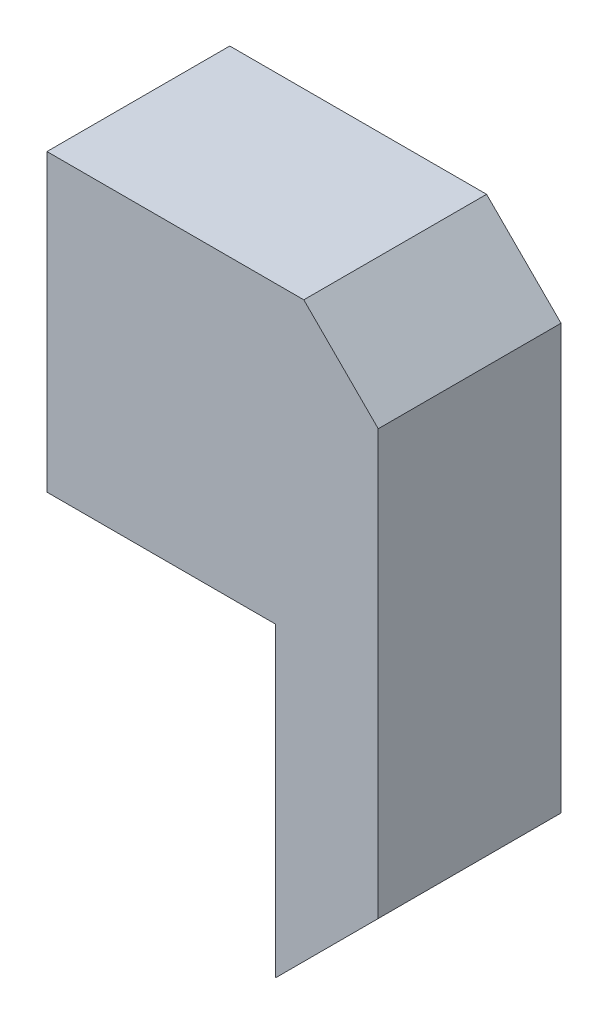
ISO-10303-21;
HEADER;
FILE_DESCRIPTION(('STEP AP214'),'2;1');
FILE_NAME('part.step','',(''),(''),'','','');
FILE_SCHEMA(('AUTOMOTIVE_DESIGN { 1 0 10303 214 1 1 1 1 }'));
ENDSEC;
DATA;
#1=APPLICATION_CONTEXT('core data for automotive mechanical design processes');
#2=APPLICATION_PROTOCOL_DEFINITION('international standard','automotive_design',2000,#1);
#3=PRODUCT_CONTEXT('',#1,'mechanical');
#4=PRODUCT('Part','Part','',(#3));
#5=PRODUCT_RELATED_PRODUCT_CATEGORY('part','',(#4));
#6=PRODUCT_DEFINITION_FORMATION('','',#4);
#7=PRODUCT_DEFINITION_CONTEXT('part definition',#1,'design');
#8=PRODUCT_DEFINITION('design','',#6,#7);
#9=PRODUCT_DEFINITION_SHAPE('','',#8);
#10=(LENGTH_UNIT() NAMED_UNIT(*) SI_UNIT(.MILLI.,.METRE.));
#11=(NAMED_UNIT(*) PLANE_ANGLE_UNIT() SI_UNIT($,.RADIAN.));
#12=(NAMED_UNIT(*) SI_UNIT($,.STERADIAN.) SOLID_ANGLE_UNIT());
#13=UNCERTAINTY_MEASURE_WITH_UNIT(LENGTH_MEASURE(1.E-05),#10,'distance_accuracy_value','');
#14=(GEOMETRIC_REPRESENTATION_CONTEXT(3) GLOBAL_UNCERTAINTY_ASSIGNED_CONTEXT((#13)) GLOBAL_UNIT_ASSIGNED_CONTEXT((#10,
#11,#12)) REPRESENTATION_CONTEXT('',''));
#15=CARTESIAN_POINT('',(0.,0.,0.));
#16=DIRECTION('',(0.,0.,1.));
#17=DIRECTION('',(1.,0.,0.));
#18=AXIS2_PLACEMENT_3D('',#15,#16,#17);
#19=CARTESIAN_POINT('',(313.287913377162,0.,-250.825));
#20=DIRECTION('',(0.,-1.,0.));
#21=DIRECTION('',(1.,0.,0.));
#22=AXIS2_PLACEMENT_3D('',#19,#20,#21);
#23=PLANE('',#22);
#24=DIRECTION('',(0.,0.,1.));
#25=VECTOR('',#24,1.);
#26=CARTESIAN_POINT('',(1.5875,0.,-250.825));
#27=LINE('',#26,#25);
#28=CARTESIAN_POINT('',(1.5875,0.,-249.2375));
#29=VERTEX_POINT('',#28);
#30=CARTESIAN_POINT('',(1.5875,0.,-1.5875));
#31=VERTEX_POINT('',#30);
#32=EDGE_CURVE('E140',#29,#31,#27,.T.);
#33=ORIENTED_EDGE('',*,*,#32,.T.);
#34=DIRECTION('',(1.,0.,0.));
#35=VECTOR('',#34,1.);
#36=CARTESIAN_POINT('',(313.287913377162,0.,-1.58749999999999));
#37=LINE('',#36,#35);
#38=CARTESIAN_POINT('',(313.287913377162,0.,-1.58749999999999));
#39=VERTEX_POINT('',#38);
#40=EDGE_CURVE('E169',#31,#39,#37,.T.);
#41=ORIENTED_EDGE('',*,*,#40,.T.);
#42=DIRECTION('',(0.,0.,1.));
#43=VECTOR('',#42,1.);
#44=CARTESIAN_POINT('',(313.287913377162,0.,-250.825));
#45=LINE('',#44,#43);
#46=CARTESIAN_POINT('',(313.287913377162,0.,0.));
#47=VERTEX_POINT('',#46);
#48=EDGE_CURVE('E135',#39,#47,#45,.T.);
#49=ORIENTED_EDGE('',*,*,#48,.T.);
#50=DIRECTION('',(1.,0.,0.));
#51=VECTOR('',#50,1.);
#52=CARTESIAN_POINT('',(313.287913377162,0.,0.));
#53=LINE('',#52,#51);
#54=CARTESIAN_POINT('',(0.,0.,0.));
#55=VERTEX_POINT('',#54);
#56=EDGE_CURVE('E136',#55,#47,#53,.T.);
#57=ORIENTED_EDGE('',*,*,#56,.F.);
#58=DIRECTION('',(0.,0.,1.));
#59=VECTOR('',#58,1.);
#60=CARTESIAN_POINT('',(0.,0.,-250.825));
#61=LINE('',#60,#59);
#62=CARTESIAN_POINT('',(0.,0.,-250.825));
#63=VERTEX_POINT('',#62);
#64=EDGE_CURVE('E11',#63,#55,#61,.T.);
#65=ORIENTED_EDGE('',*,*,#64,.F.);
#66=DIRECTION('',(1.,0.,0.));
#67=VECTOR('',#66,1.);
#68=CARTESIAN_POINT('',(313.287913377162,0.,-250.825));
#69=LINE('',#68,#67);
#70=CARTESIAN_POINT('',(313.287913377162,0.,-250.825));
#71=VERTEX_POINT('',#70);
#72=EDGE_CURVE('E154',#63,#71,#69,.T.);
#73=ORIENTED_EDGE('',*,*,#72,.T.);
#74=CARTESIAN_POINT('',(313.287913377162,0.,-249.2375));
#75=VERTEX_POINT('',#74);
#76=EDGE_CURVE('E34',#71,#75,#45,.T.);
#77=ORIENTED_EDGE('',*,*,#76,.T.);
#78=DIRECTION('',(1.,0.,0.));
#79=VECTOR('',#78,1.);
#80=CARTESIAN_POINT('',(313.287913377162,0.,-249.2375));
#81=LINE('',#80,#79);
#82=EDGE_CURVE('E334',#29,#75,#81,.T.);
#83=ORIENTED_EDGE('',*,*,#82,.F.);
#84=EDGE_LOOP('',(#33,#41,#49,#57,#65,#73,#77,#83));
#85=FACE_BOUND('',#84,.T.);
#86=ADVANCED_FACE('F31',(#85),#23,.T.);
#87=CARTESIAN_POINT('',(313.287913377162,-420.6875,-250.825));
#88=DIRECTION('',(-1.,0.,0.));
#89=DIRECTION('',(0.,0.,1.));
#90=AXIS2_PLACEMENT_3D('',#87,#88,#89);
#91=PLANE('',#90);
#92=ORIENTED_EDGE('',*,*,#48,.F.);
#93=DIRECTION('',(0.,-1.,0.));
#94=VECTOR('',#93,1.);
#95=CARTESIAN_POINT('',(313.287913377162,-420.6875,-1.58749999999999));
#96=LINE('',#95,#94);
#97=CARTESIAN_POINT('',(313.287913377162,-418.442435969733,-1.5875));
#98=VERTEX_POINT('',#97);
#99=EDGE_CURVE('E324',#39,#98,#96,.T.);
#100=ORIENTED_EDGE('',*,*,#99,.T.);
#101=DIRECTION('',(0.,0.,1.));
#102=VECTOR('',#101,1.);
#103=CARTESIAN_POINT('',(313.287913377162,-418.442435969733,-250.825));
#104=LINE('',#103,#102);
#105=CARTESIAN_POINT('',(313.287913377162,-418.442435969733,-249.2375));
#106=VERTEX_POINT('',#105);
#107=EDGE_CURVE('E327',#106,#98,#104,.T.);
#108=ORIENTED_EDGE('',*,*,#107,.F.);
#109=DIRECTION('',(0.,-1.,0.));
#110=VECTOR('',#109,1.);
#111=CARTESIAN_POINT('',(313.287913377162,-420.6875,-249.2375));
#112=LINE('',#111,#110);
#113=EDGE_CURVE('E47',#75,#106,#112,.T.);
#114=ORIENTED_EDGE('',*,*,#113,.F.);
#115=ORIENTED_EDGE('',*,*,#76,.F.);
#116=DIRECTION('',(0.,-1.,0.));
#117=VECTOR('',#116,1.);
#118=CARTESIAN_POINT('',(313.287913377162,-420.6875,-250.825));
#119=LINE('',#118,#117);
#120=CARTESIAN_POINT('',(313.287913377162,-420.6875,-250.825));
#121=VERTEX_POINT('',#120);
#122=EDGE_CURVE('E319',#71,#121,#119,.T.);
#123=ORIENTED_EDGE('',*,*,#122,.T.);
#124=DIRECTION('',(0.,0.,1.));
#125=VECTOR('',#124,1.);
#126=CARTESIAN_POINT('',(313.287913377162,-420.6875,-250.825));
#127=LINE('',#126,#125);
#128=CARTESIAN_POINT('',(313.287913377162,-420.6875,0.));
#129=VERTEX_POINT('',#128);
#130=EDGE_CURVE('E159',#121,#129,#127,.T.);
#131=ORIENTED_EDGE('',*,*,#130,.T.);
#132=DIRECTION('',(0.,-1.,0.));
#133=VECTOR('',#132,1.);
#134=CARTESIAN_POINT('',(313.287913377162,-420.6875,0.));
#135=LINE('',#134,#133);
#136=EDGE_CURVE('E139',#47,#129,#135,.T.);
#137=ORIENTED_EDGE('',*,*,#136,.F.);
#138=EDGE_LOOP('',(#92,#100,#108,#114,#115,#123,#131,#137));
#139=FACE_BOUND('',#138,.T.);
#140=ADVANCED_FACE('F171',(#139),#91,.T.);
#141=CARTESIAN_POINT('',(0.,0.,-250.825));
#142=DIRECTION('',(-1.,0.,0.));
#143=DIRECTION('',(0.,0.,1.));
#144=AXIS2_PLACEMENT_3D('',#141,#142,#143);
#145=PLANE('',#144);
#146=DIRECTION('',(0.,-1.,0.));
#147=VECTOR('',#146,1.);
#148=CARTESIAN_POINT('',(0.,0.,0.));
#149=LINE('',#148,#147);
#150=CARTESIAN_POINT('',(0.,404.8125,0.));
#151=VERTEX_POINT('',#150);
#152=EDGE_CURVE('E152',#151,#55,#149,.T.);
#153=ORIENTED_EDGE('',*,*,#152,.F.);
#154=DIRECTION('',(0.,0.,1.));
#155=VECTOR('',#154,1.);
#156=CARTESIAN_POINT('',(0.,404.8125,-250.825));
#157=LINE('',#156,#155);
#158=CARTESIAN_POINT('',(0.,404.8125,-250.825));
#159=VERTEX_POINT('',#158);
#160=EDGE_CURVE('E39',#159,#151,#157,.T.);
#161=ORIENTED_EDGE('',*,*,#160,.F.);
#162=DIRECTION('',(0.,-1.,0.));
#163=VECTOR('',#162,1.);
#164=CARTESIAN_POINT('',(0.,0.,-250.825));
#165=LINE('',#164,#163);
#166=EDGE_CURVE('E125',#159,#63,#165,.T.);
#167=ORIENTED_EDGE('',*,*,#166,.T.);
#168=ORIENTED_EDGE('',*,*,#64,.T.);
#169=EDGE_LOOP('',(#153,#161,#167,#168));
#170=FACE_BOUND('',#169,.T.);
#171=ADVANCED_FACE('F174',(#170),#145,.T.);
#172=CARTESIAN_POINT('',(0.,404.8125,-250.825));
#173=DIRECTION('',(0.,1.,0.));
#174=DIRECTION('',(0.,0.,1.));
#175=AXIS2_PLACEMENT_3D('',#172,#173,#174);
#176=PLANE('',#175);
#177=DIRECTION('',(-1.,0.,0.));
#178=VECTOR('',#177,1.);
#179=CARTESIAN_POINT('',(0.,404.8125,0.));
#180=LINE('',#179,#178);
#181=CARTESIAN_POINT('',(352.425,404.8125,0.));
#182=VERTEX_POINT('',#181);
#183=EDGE_CURVE('E112',#182,#151,#180,.T.);
#184=ORIENTED_EDGE('',*,*,#183,.F.);
#185=DIRECTION('',(0.,0.,1.));
#186=VECTOR('',#185,1.);
#187=CARTESIAN_POINT('',(352.425,404.8125,-250.825));
#188=LINE('',#187,#186);
#189=CARTESIAN_POINT('',(352.425,404.8125,-250.825));
#190=VERTEX_POINT('',#189);
#191=EDGE_CURVE('E106',#190,#182,#188,.T.);
#192=ORIENTED_EDGE('',*,*,#191,.F.);
#193=DIRECTION('',(-1.,0.,0.));
#194=VECTOR('',#193,1.);
#195=CARTESIAN_POINT('',(0.,404.8125,-250.825));
#196=LINE('',#195,#194);
#197=EDGE_CURVE('E109',#190,#159,#196,.T.);
#198=ORIENTED_EDGE('',*,*,#197,.T.);
#199=ORIENTED_EDGE('',*,*,#160,.T.);
#200=EDGE_LOOP('',(#184,#192,#198,#199));
#201=FACE_BOUND('',#200,.T.);
#202=ADVANCED_FACE('F108',(#201),#176,.T.);
#203=CARTESIAN_POINT('',(352.425,404.8125,-250.825));
#204=DIRECTION('',(0.707106781186546,0.70710678118655,0.));
#205=DIRECTION('',(-0.70710678118655,0.707106781186545,0.));
#206=AXIS2_PLACEMENT_3D('',#203,#204,#205);
#207=PLANE('',#206);
#208=DIRECTION('',(-0.70710678118655,0.707106781186545,0.));
#209=VECTOR('',#208,1.);
#210=CARTESIAN_POINT('',(352.425,404.8125,0.));
#211=LINE('',#210,#209);
#212=CARTESIAN_POINT('',(454.575413377162,302.662086622839,0.));
#213=VERTEX_POINT('',#212);
#214=EDGE_CURVE('E149',#213,#182,#211,.T.);
#215=ORIENTED_EDGE('',*,*,#214,.F.);
#216=DIRECTION('',(0.,0.,1.));
#217=VECTOR('',#216,1.);
#218=CARTESIAN_POINT('',(454.575413377162,302.662086622839,-250.825));
#219=LINE('',#218,#217);
#220=CARTESIAN_POINT('',(454.575413377162,302.662086622839,-250.825));
#221=VERTEX_POINT('',#220);
#222=EDGE_CURVE('E117',#221,#213,#219,.T.);
#223=ORIENTED_EDGE('',*,*,#222,.F.);
#224=DIRECTION('',(-0.70710678118655,0.707106781186545,0.));
#225=VECTOR('',#224,1.);
#226=CARTESIAN_POINT('',(352.425,404.8125,-250.825));
#227=LINE('',#226,#225);
#228=EDGE_CURVE('E123',#221,#190,#227,.T.);
#229=ORIENTED_EDGE('',*,*,#228,.T.);
#230=ORIENTED_EDGE('',*,*,#191,.T.);
#231=EDGE_LOOP('',(#215,#223,#229,#230));
#232=FACE_BOUND('',#231,.T.);
#233=ADVANCED_FACE('F127',(#232),#207,.T.);
#234=CARTESIAN_POINT('',(454.575413377162,302.662086622839,-250.825));
#235=DIRECTION('',(1.,0.,0.));
#236=DIRECTION('',(0.,1.,0.));
#237=AXIS2_PLACEMENT_3D('',#234,#235,#236);
#238=PLANE('',#237);
#239=DIRECTION('',(0.,1.,0.));
#240=VECTOR('',#239,1.);
#241=CARTESIAN_POINT('',(454.575413377162,302.662086622839,0.));
#242=LINE('',#241,#240);
#243=CARTESIAN_POINT('',(454.575413377162,-279.4,0.));
#244=VERTEX_POINT('',#243);
#245=EDGE_CURVE('E146',#244,#213,#242,.T.);
#246=ORIENTED_EDGE('',*,*,#245,.F.);
#247=DIRECTION('',(0.,0.,1.));
#248=VECTOR('',#247,1.);
#249=CARTESIAN_POINT('',(454.575413377162,-279.4,-250.825));
#250=LINE('',#249,#248);
#251=CARTESIAN_POINT('',(454.575413377162,-279.4,-250.825));
#252=VERTEX_POINT('',#251);
#253=EDGE_CURVE('E158',#252,#244,#250,.T.);
#254=ORIENTED_EDGE('',*,*,#253,.F.);
#255=DIRECTION('',(0.,1.,0.));
#256=VECTOR('',#255,1.);
#257=CARTESIAN_POINT('',(454.575413377162,302.662086622839,-250.825));
#258=LINE('',#257,#256);
#259=EDGE_CURVE('E128',#252,#221,#258,.T.);
#260=ORIENTED_EDGE('',*,*,#259,.T.);
#261=ORIENTED_EDGE('',*,*,#222,.T.);
#262=EDGE_LOOP('',(#246,#254,#260,#261));
#263=FACE_BOUND('',#262,.T.);
#264=ADVANCED_FACE('F279',(#263),#238,.T.);
#265=CARTESIAN_POINT('',(454.575413377162,-279.4,-250.825));
#266=DIRECTION('',(0.707106781186547,-0.707106781186548,0.));
#267=DIRECTION('',(0.707106781186548,0.707106781186547,0.));
#268=AXIS2_PLACEMENT_3D('',#265,#266,#267);
#269=PLANE('',#268);
#270=DIRECTION('',(0.707106781186548,0.707106781186547,0.));
#271=VECTOR('',#270,1.);
#272=CARTESIAN_POINT('',(454.575413377162,-279.4,0.));
#273=LINE('',#272,#271);
#274=EDGE_CURVE('E143',#129,#244,#273,.T.);
#275=ORIENTED_EDGE('',*,*,#274,.F.);
#276=ORIENTED_EDGE('',*,*,#130,.F.);
#277=DIRECTION('',(0.707106781186548,0.707106781186547,0.));
#278=VECTOR('',#277,1.);
#279=CARTESIAN_POINT('',(454.575413377162,-279.4,-250.825));
#280=LINE('',#279,#278);
#281=EDGE_CURVE('E130',#121,#252,#280,.T.);
#282=ORIENTED_EDGE('',*,*,#281,.T.);
#283=ORIENTED_EDGE('',*,*,#253,.T.);
#284=EDGE_LOOP('',(#275,#276,#282,#283));
#285=FACE_BOUND('',#284,.T.);
#286=ADVANCED_FACE('F268',(#285),#269,.T.);
#287=CARTESIAN_POINT('',(0.,0.,-250.825));
#288=DIRECTION('',(0.,0.,-1.));
#289=DIRECTION('',(-1.,0.,0.));
#290=AXIS2_PLACEMENT_3D('',#287,#288,#289);
#291=PLANE('',#290);
#292=ORIENTED_EDGE('',*,*,#72,.F.);
#293=ORIENTED_EDGE('',*,*,#166,.F.);
#294=ORIENTED_EDGE('',*,*,#197,.F.);
#295=ORIENTED_EDGE('',*,*,#228,.F.);
#296=ORIENTED_EDGE('',*,*,#259,.F.);
#297=ORIENTED_EDGE('',*,*,#281,.F.);
#298=ORIENTED_EDGE('',*,*,#122,.F.);
#299=EDGE_LOOP('',(#292,#293,#294,#295,#296,#297,#298));
#300=FACE_BOUND('',#299,.T.);
#301=ADVANCED_FACE('F121',(#300),#291,.T.);
#302=CARTESIAN_POINT('',(0.,0.,0.));
#303=DIRECTION('',(0.,0.,-1.));
#304=DIRECTION('',(-1.,0.,0.));
#305=AXIS2_PLACEMENT_3D('',#302,#303,#304);
#306=PLANE('',#305);
#307=ORIENTED_EDGE('',*,*,#56,.T.);
#308=ORIENTED_EDGE('',*,*,#136,.T.);
#309=ORIENTED_EDGE('',*,*,#274,.T.);
#310=ORIENTED_EDGE('',*,*,#245,.T.);
#311=ORIENTED_EDGE('',*,*,#214,.T.);
#312=ORIENTED_EDGE('',*,*,#183,.T.);
#313=ORIENTED_EDGE('',*,*,#152,.T.);
#314=EDGE_LOOP('',(#307,#308,#309,#310,#311,#312,#313));
#315=FACE_BOUND('',#314,.T.);
#316=ADVANCED_FACE('F173',(#315),#306,.F.);
#317=CARTESIAN_POINT('',(1.5875,0.,-250.825));
#318=DIRECTION('',(-1.,0.,0.));
#319=DIRECTION('',(0.,0.,1.));
#320=AXIS2_PLACEMENT_3D('',#317,#318,#319);
#321=PLANE('',#320);
#322=DIRECTION('',(0.,-1.,0.));
#323=VECTOR('',#322,1.);
#324=CARTESIAN_POINT('',(1.5875,0.,-1.58749999999999));
#325=LINE('',#324,#323);
#326=CARTESIAN_POINT('',(1.5875,403.225,-1.5875));
#327=VERTEX_POINT('',#326);
#328=EDGE_CURVE('E336',#327,#31,#325,.T.);
#329=ORIENTED_EDGE('',*,*,#328,.T.);
#330=ORIENTED_EDGE('',*,*,#32,.F.);
#331=DIRECTION('',(0.,-1.,0.));
#332=VECTOR('',#331,1.);
#333=CARTESIAN_POINT('',(1.5875,0.,-249.2375));
#334=LINE('',#333,#332);
#335=CARTESIAN_POINT('',(1.5875,403.225,-249.2375));
#336=VERTEX_POINT('',#335);
#337=EDGE_CURVE('E331',#336,#29,#334,.T.);
#338=ORIENTED_EDGE('',*,*,#337,.F.);
#339=DIRECTION('',(0.,0.,1.));
#340=VECTOR('',#339,1.);
#341=CARTESIAN_POINT('',(1.5875,403.225,-250.825));
#342=LINE('',#341,#340);
#343=EDGE_CURVE('E338',#336,#327,#342,.T.);
#344=ORIENTED_EDGE('',*,*,#343,.T.);
#345=EDGE_LOOP('',(#329,#330,#338,#344));
#346=FACE_BOUND('',#345,.T.);
#347=ADVANCED_FACE('F197',(#346),#321,.F.);
#348=CARTESIAN_POINT('',(0.,403.225,-250.825));
#349=DIRECTION('',(0.,1.,0.));
#350=DIRECTION('',(0.,0.,1.));
#351=AXIS2_PLACEMENT_3D('',#348,#349,#350);
#352=PLANE('',#351);
#353=DIRECTION('',(-1.,0.,0.));
#354=VECTOR('',#353,1.);
#355=CARTESIAN_POINT('',(0.,403.225,-1.58749999999999));
#356=LINE('',#355,#354);
#357=CARTESIAN_POINT('',(351.767435969733,403.225,-1.5875));
#358=VERTEX_POINT('',#357);
#359=EDGE_CURVE('E361',#358,#327,#356,.T.);
#360=ORIENTED_EDGE('',*,*,#359,.T.);
#361=ORIENTED_EDGE('',*,*,#343,.F.);
#362=DIRECTION('',(-1.,0.,0.));
#363=VECTOR('',#362,1.);
#364=CARTESIAN_POINT('',(0.,403.225,-249.2375));
#365=LINE('',#364,#363);
#366=CARTESIAN_POINT('',(351.767435969733,403.225,-249.2375));
#367=VERTEX_POINT('',#366);
#368=EDGE_CURVE('E355',#367,#336,#365,.T.);
#369=ORIENTED_EDGE('',*,*,#368,.F.);
#370=DIRECTION('',(0.,0.,1.));
#371=VECTOR('',#370,1.);
#372=CARTESIAN_POINT('',(351.767435969733,403.225,-250.825));
#373=LINE('',#372,#371);
#374=EDGE_CURVE('E358',#367,#358,#373,.T.);
#375=ORIENTED_EDGE('',*,*,#374,.T.);
#376=EDGE_LOOP('',(#360,#361,#369,#375));
#377=FACE_BOUND('',#376,.T.);
#378=ADVANCED_FACE('F202',(#377),#352,.F.);
#379=CARTESIAN_POINT('',(351.302467984866,403.689967984866,-250.825));
#380=DIRECTION('',(0.707106781186546,0.70710678118655,0.));
#381=DIRECTION('',(-0.70710678118655,0.707106781186545,0.));
#382=AXIS2_PLACEMENT_3D('',#379,#380,#381);
#383=PLANE('',#382);
#384=DIRECTION('',(-0.70710678118655,0.707106781186545,0.));
#385=VECTOR('',#384,1.);
#386=CARTESIAN_POINT('',(351.302467984866,403.689967984866,-1.58749999999999));
#387=LINE('',#386,#385);
#388=CARTESIAN_POINT('',(452.987913377162,302.004522592571,-1.5875));
#389=VERTEX_POINT('',#388);
#390=EDGE_CURVE('E352',#389,#358,#387,.T.);
#391=ORIENTED_EDGE('',*,*,#390,.T.);
#392=ORIENTED_EDGE('',*,*,#374,.F.);
#393=DIRECTION('',(-0.70710678118655,0.707106781186545,0.));
#394=VECTOR('',#393,1.);
#395=CARTESIAN_POINT('',(351.302467984866,403.689967984866,-249.2375));
#396=LINE('',#395,#394);
#397=CARTESIAN_POINT('',(452.987913377162,302.004522592571,-249.2375));
#398=VERTEX_POINT('',#397);
#399=EDGE_CURVE('E346',#398,#367,#396,.T.);
#400=ORIENTED_EDGE('',*,*,#399,.F.);
#401=DIRECTION('',(0.,0.,1.));
#402=VECTOR('',#401,1.);
#403=CARTESIAN_POINT('',(452.987913377162,302.004522592571,-250.825));
#404=LINE('',#403,#402);
#405=EDGE_CURVE('E349',#398,#389,#404,.T.);
#406=ORIENTED_EDGE('',*,*,#405,.T.);
#407=EDGE_LOOP('',(#391,#392,#400,#406));
#408=FACE_BOUND('',#407,.T.);
#409=ADVANCED_FACE('F213',(#408),#383,.F.);
#410=CARTESIAN_POINT('',(452.987913377162,302.662086622839,-250.825));
#411=DIRECTION('',(1.,0.,0.));
#412=DIRECTION('',(0.,1.,0.));
#413=AXIS2_PLACEMENT_3D('',#410,#411,#412);
#414=PLANE('',#413);
#415=DIRECTION('',(0.,1.,0.));
#416=VECTOR('',#415,1.);
#417=CARTESIAN_POINT('',(452.987913377162,302.662086622839,-1.58749999999999));
#418=LINE('',#417,#416);
#419=CARTESIAN_POINT('',(452.987913377162,-278.742435969733,-1.5875));
#420=VERTEX_POINT('',#419);
#421=EDGE_CURVE('E343',#420,#389,#418,.T.);
#422=ORIENTED_EDGE('',*,*,#421,.T.);
#423=ORIENTED_EDGE('',*,*,#405,.F.);
#424=DIRECTION('',(0.,1.,0.));
#425=VECTOR('',#424,1.);
#426=CARTESIAN_POINT('',(452.987913377162,302.662086622839,-249.2375));
#427=LINE('',#426,#425);
#428=CARTESIAN_POINT('',(452.987913377162,-278.742435969733,-249.2375));
#429=VERTEX_POINT('',#428);
#430=EDGE_CURVE('E340',#429,#398,#427,.T.);
#431=ORIENTED_EDGE('',*,*,#430,.F.);
#432=DIRECTION('',(0.,0.,1.));
#433=VECTOR('',#432,1.);
#434=CARTESIAN_POINT('',(452.987913377162,-278.742435969733,-250.825));
#435=LINE('',#434,#433);
#436=EDGE_CURVE('E330',#429,#420,#435,.T.);
#437=ORIENTED_EDGE('',*,*,#436,.T.);
#438=EDGE_LOOP('',(#422,#423,#431,#437));
#439=FACE_BOUND('',#438,.T.);
#440=ADVANCED_FACE('F223',(#439),#414,.F.);
#441=CARTESIAN_POINT('',(453.452881362028,-278.277467984867,-250.825));
#442=DIRECTION('',(0.707106781186547,-0.707106781186548,0.));
#443=DIRECTION('',(0.707106781186548,0.707106781186547,0.));
#444=AXIS2_PLACEMENT_3D('',#441,#442,#443);
#445=PLANE('',#444);
#446=DIRECTION('',(0.707106781186548,0.707106781186547,0.));
#447=VECTOR('',#446,1.);
#448=CARTESIAN_POINT('',(453.452881362028,-278.277467984867,-1.58749999999999));
#449=LINE('',#448,#447);
#450=EDGE_CURVE('E326',#98,#420,#449,.T.);
#451=ORIENTED_EDGE('',*,*,#450,.T.);
#452=ORIENTED_EDGE('',*,*,#436,.F.);
#453=DIRECTION('',(0.707106781186548,0.707106781186547,0.));
#454=VECTOR('',#453,1.);
#455=CARTESIAN_POINT('',(453.452881362028,-278.277467984867,-249.2375));
#456=LINE('',#455,#454);
#457=EDGE_CURVE('E333',#106,#429,#456,.T.);
#458=ORIENTED_EDGE('',*,*,#457,.F.);
#459=ORIENTED_EDGE('',*,*,#107,.T.);
#460=EDGE_LOOP('',(#451,#452,#458,#459));
#461=FACE_BOUND('',#460,.T.);
#462=ADVANCED_FACE('F233',(#461),#445,.F.);
#463=CARTESIAN_POINT('',(0.,0.,-249.2375));
#464=DIRECTION('',(0.,0.,-1.));
#465=DIRECTION('',(-1.,0.,0.));
#466=AXIS2_PLACEMENT_3D('',#463,#464,#465);
#467=PLANE('',#466);
#468=ORIENTED_EDGE('',*,*,#82,.T.);
#469=ORIENTED_EDGE('',*,*,#113,.T.);
#470=ORIENTED_EDGE('',*,*,#457,.T.);
#471=ORIENTED_EDGE('',*,*,#430,.T.);
#472=ORIENTED_EDGE('',*,*,#399,.T.);
#473=ORIENTED_EDGE('',*,*,#368,.T.);
#474=ORIENTED_EDGE('',*,*,#337,.T.);
#475=EDGE_LOOP('',(#468,#469,#470,#471,#472,#473,#474));
#476=FACE_BOUND('',#475,.T.);
#477=ADVANCED_FACE('F243',(#476),#467,.F.);
#478=CARTESIAN_POINT('',(0.,0.,-1.5875));
#479=DIRECTION('',(0.,0.,-1.));
#480=DIRECTION('',(-1.,0.,0.));
#481=AXIS2_PLACEMENT_3D('',#478,#479,#480);
#482=PLANE('',#481);
#483=ORIENTED_EDGE('',*,*,#40,.F.);
#484=ORIENTED_EDGE('',*,*,#328,.F.);
#485=ORIENTED_EDGE('',*,*,#359,.F.);
#486=ORIENTED_EDGE('',*,*,#390,.F.);
#487=ORIENTED_EDGE('',*,*,#421,.F.);
#488=ORIENTED_EDGE('',*,*,#450,.F.);
#489=ORIENTED_EDGE('',*,*,#99,.F.);
#490=EDGE_LOOP('',(#483,#484,#485,#486,#487,#488,#489));
#491=FACE_BOUND('',#490,.T.);
#492=ADVANCED_FACE('F253',(#491),#482,.T.);
#493=CLOSED_SHELL('',(#86,#140,#171,#202,#233,#264,#286,#301,#316,#347,#378,#409,#440,#462,#477,#492));
#494=MANIFOLD_SOLID_BREP('B2',#493);
#495=ADVANCED_BREP_SHAPE_REPRESENTATION('',(#18,#494),#14);
#496=SHAPE_DEFINITION_REPRESENTATION(#9,#495);
ENDSEC;
END-ISO-10303-21;
